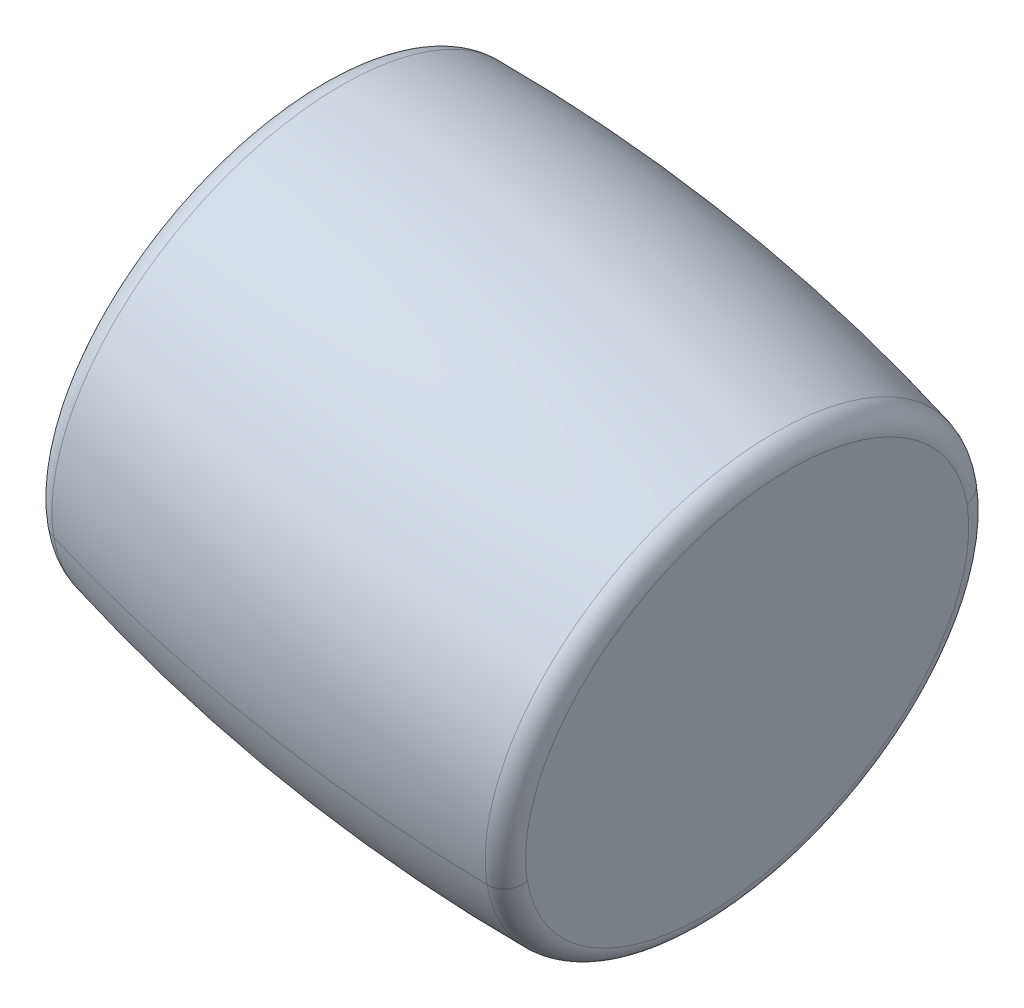
ISO-10303-21;
HEADER;
FILE_DESCRIPTION(('STEP AP214'),'2;1');
FILE_NAME('part.step','',(''),(''),'','','');
FILE_SCHEMA(('AUTOMOTIVE_DESIGN { 1 0 10303 214 1 1 1 1 }'));
ENDSEC;
DATA;
#1=APPLICATION_CONTEXT('core data for automotive mechanical design processes');
#2=APPLICATION_PROTOCOL_DEFINITION('international standard','automotive_design',2000,#1);
#3=PRODUCT_CONTEXT('',#1,'mechanical');
#4=PRODUCT('Part','Part','',(#3));
#5=PRODUCT_RELATED_PRODUCT_CATEGORY('part','',(#4));
#6=PRODUCT_DEFINITION_FORMATION('','',#4);
#7=PRODUCT_DEFINITION_CONTEXT('part definition',#1,'design');
#8=PRODUCT_DEFINITION('design','',#6,#7);
#9=PRODUCT_DEFINITION_SHAPE('','',#8);
#10=(LENGTH_UNIT() NAMED_UNIT(*) SI_UNIT(.MILLI.,.METRE.));
#11=(NAMED_UNIT(*) PLANE_ANGLE_UNIT() SI_UNIT($,.RADIAN.));
#12=(NAMED_UNIT(*) SI_UNIT($,.STERADIAN.) SOLID_ANGLE_UNIT());
#13=UNCERTAINTY_MEASURE_WITH_UNIT(LENGTH_MEASURE(1.E-05),#10,'distance_accuracy_value','');
#14=(GEOMETRIC_REPRESENTATION_CONTEXT(3) GLOBAL_UNCERTAINTY_ASSIGNED_CONTEXT((#13)) GLOBAL_UNIT_ASSIGNED_CONTEXT((#10,
#11,#12)) REPRESENTATION_CONTEXT('',''));
#15=CARTESIAN_POINT('',(0.,0.,0.));
#16=DIRECTION('',(0.,0.,1.));
#17=DIRECTION('',(1.,0.,0.));
#18=AXIS2_PLACEMENT_3D('',#15,#16,#17);
#19=CARTESIAN_POINT('',(48.3031514731134,99.1878484237131,0.));
#20=DIRECTION('',(0.981627183447663,-0.19080899537655,0.));
#21=DIRECTION('',(0.19080899537655,0.981627183447663,0.));
#22=AXIS2_PLACEMENT_3D('',#19,#20,#21);
#23=PLANE('',#22);
#24=CARTESIAN_POINT('',(47.4192131955093,94.6403802077987,14.2576207137951));
#25=CARTESIAN_POINT('',(47.3746990564591,94.4113748149806,14.1818251436028));
#26=CARTESIAN_POINT('',(47.33054058584,94.1841991776182,14.1002941965935));
#27=CARTESIAN_POINT('',(47.2430398123791,93.7340467221097,13.9259793446129));
#28=CARTESIAN_POINT('',(47.1996975095374,93.5110699039636,13.8331954396415));
#29=CARTESIAN_POINT('',(47.113933902546,93.0698543951923,13.6365924674086));
#30=CARTESIAN_POINT('',(47.0715125983965,92.8516157045672,13.532773400147));
#31=CARTESIAN_POINT('',(46.9876930740912,92.4204016341856,13.3143517476095));
#32=CARTESIAN_POINT('',(46.9462948539354,92.2074262544292,13.1997491623336));
#33=CARTESIAN_POINT('',(46.8646212593884,91.7872520356035,12.960036150118));
#34=CARTESIAN_POINT('',(46.8243458849971,91.5800531965343,12.8349257231784));
#35=CARTESIAN_POINT('',(46.7450150008902,91.1719311781116,12.5744985398239));
#36=CARTESIAN_POINT('',(46.7059594911746,90.9710079987581,12.4391817834091));
#37=CARTESIAN_POINT('',(46.6291624267044,90.5759213523236,12.1586679014917));
#38=CARTESIAN_POINT('',(46.59142087195,90.3817578852425,12.0134707759891));
#39=CARTESIAN_POINT('',(46.5173426395395,90.0006584171994,11.7135459564021));
#40=CARTESIAN_POINT('',(46.4810059618835,89.8137224162373,11.5588182623176));
#41=CARTESIAN_POINT('',(46.409825022063,89.4475282264231,11.2402050560143));
#42=CARTESIAN_POINT('',(46.3749807598985,89.268270037571,11.0763195437954));
#43=CARTESIAN_POINT('',(46.3068685938992,88.9178633204429,10.7397855163449));
#44=CARTESIAN_POINT('',(46.2736006900644,88.746714792167,10.5671370011133));
#45=CARTESIAN_POINT('',(46.20872138603,88.4129397080434,10.2134928928804));
#46=CARTESIAN_POINT('',(46.1771099858304,88.2503131521958,10.0324972998793));
#47=CARTESIAN_POINT('',(46.1156198436951,87.9339737945312,9.662595070385));
#48=CARTESIAN_POINT('',(46.0857411017595,87.7802609927142,9.47368843389193));
#49=CARTESIAN_POINT('',(46.0277882566595,87.4821194507182,9.08841921003655));
#50=CARTESIAN_POINT('',(45.9997141534951,87.3376907105391,8.89205662267425));
#51=CARTESIAN_POINT('',(45.9454382189109,87.0584652333034,8.49234855175562));
#52=CARTESIAN_POINT('',(45.9192363874911,86.9236684962466,8.28900306819929));
#53=CARTESIAN_POINT('',(45.8687681189029,86.6640317624023,7.8758190819727));
#54=CARTESIAN_POINT('',(45.8445016817345,86.5391917656147,7.66598057930242));
#55=CARTESIAN_POINT('',(45.797962661622,86.2997692627952,7.24031607418074));
#56=CARTESIAN_POINT('',(45.7756900786778,86.1851867567635,7.02449007172933));
#57=CARTESIAN_POINT('',(45.7331924236166,85.9665552747492,6.58737051078937));
#58=CARTESIAN_POINT('',(45.7129673514996,85.8625062987667,6.36607695230081));
#59=CARTESIAN_POINT('',(45.6746134420632,85.6651925399476,5.91855539485197));
#60=CARTESIAN_POINT('',(45.6564846047438,85.571927757111,5.69232739589169));
#61=CARTESIAN_POINT('',(45.6223668388594,85.3964070676147,5.23548196056415));
#62=CARTESIAN_POINT('',(45.6063779102945,85.3141511609549,5.00486452419688));
#63=CARTESIAN_POINT('',(45.5765784806486,85.1608463854962,4.53979579165928));
#64=CARTESIAN_POINT('',(45.5627679795675,85.0897975166972,4.30534449548894));
#65=CARTESIAN_POINT('',(45.5373586755961,84.9590779799081,3.83317285705315));
#66=CARTESIAN_POINT('',(45.5257598727057,84.8994073119179,3.59545251478771));
#67=CARTESIAN_POINT('',(45.5048019076477,84.7915879286122,3.11731547328809));
#68=CARTESIAN_POINT('',(45.4954427454801,84.7434392132966,2.87689877405391));
#69=CARTESIAN_POINT('',(45.478986608909,84.6587797298124,2.39394820350329));
#70=CARTESIAN_POINT('',(45.4718896345056,84.6222689616439,2.15141433218685));
#71=CARTESIAN_POINT('',(45.4599749706958,84.5609733300925,1.66481370281116));
#72=CARTESIAN_POINT('',(45.4551572812895,84.5361884667095,1.42074694475191));
#73=CARTESIAN_POINT('',(45.4478127937098,84.4984043536359,0.93166852008849));
#74=CARTESIAN_POINT('',(45.4452859955363,84.4854051039454,0.686656853484321));
#75=CARTESIAN_POINT('',(45.4425293777005,84.4712235345876,0.196278866296406));
#76=CARTESIAN_POINT('',(45.4422995580381,84.4700412149205,-0.0490874542873405));
#77=CARTESIAN_POINT('',(45.44413745088,84.4794963539212,-0.539583640476581));
#78=CARTESIAN_POINT('',(45.4462051633843,84.4901338125892,-0.784713506082074));
#79=CARTESIAN_POINT('',(45.4526331392592,84.5232028816905,-1.27414624299772));
#80=CARTESIAN_POINT('',(45.4569934026296,84.5456344921239,-1.51844911430787));
#81=CARTESIAN_POINT('',(45.4679959759804,84.6022378250418,-2.00563931561744));
#82=CARTESIAN_POINT('',(45.4746382859608,84.6364095475263,-2.24852664561687));
#83=CARTESIAN_POINT('',(45.4901889506246,84.7164107818738,-2.73230062745259));
#84=CARTESIAN_POINT('',(45.4990973053082,84.7622402937369,-2.9731872792889));
#85=CARTESIAN_POINT('',(45.5191585983719,84.8654466995333,-3.45237958775493));
#86=CARTESIAN_POINT('',(45.530311536752,84.9228235934666,-3.69068524438467));
#87=CARTESIAN_POINT('',(45.5548351288034,85.0489865374405,-4.16414146323763));
#88=CARTESIAN_POINT('',(45.5682057824747,85.1177725874811,-4.39929202546087));
#89=CARTESIAN_POINT('',(45.5971325940324,85.2665881320499,-4.86587155719969));
#90=CARTESIAN_POINT('',(45.612688751919,85.3466176265781,-5.09730052671527));
#91=CARTESIAN_POINT('',(45.6459490957604,85.5177272620602,-5.55587934038043));
#92=CARTESIAN_POINT('',(45.6636532817153,85.608807403014,-5.78302918453001));
#93=CARTESIAN_POINT('',(45.7011670307589,85.8017989113101,-6.23250252359264));
#94=CARTESIAN_POINT('',(45.7209765938475,85.9037102786524,-6.45482601850568));
#95=CARTESIAN_POINT('',(45.7626533741859,86.1181187263149,-6.89411106232277));
#96=CARTESIAN_POINT('',(45.7845205914357,86.2306158066352,-7.1110726112268));
#97=CARTESIAN_POINT('',(45.8302600000546,86.4659246649339,-7.53911108365095));
#98=CARTESIAN_POINT('',(45.8541321914238,86.5887364429122,-7.75018800717107));
#99=CARTESIAN_POINT('',(45.9038240380816,86.8443788321966,-8.16594872603048));
#100=CARTESIAN_POINT('',(45.9296436933702,86.9772094435027,-8.37063252136977));
#101=CARTESIAN_POINT('',(45.9831682660558,87.2525694988656,-8.77311388267637));
#102=CARTESIAN_POINT('',(46.0108731834528,87.3950989429223,-8.97091144864368));
#103=CARTESIAN_POINT('',(46.0681015367824,87.6895132978715,-9.35914383954487));
#104=CARTESIAN_POINT('',(46.097624972715,87.8413982087639,-9.54957866447875));
#105=CARTESIAN_POINT('',(46.1584192385729,88.1541575933307,-9.92262679913972));
#106=CARTESIAN_POINT('',(46.189690068498,88.315032067005,-10.1052401088668));
#107=CARTESIAN_POINT('',(46.2539037881727,88.6453830164375,-10.462205281656));
#108=CARTESIAN_POINT('',(46.2868466779221,88.8148594921957,-10.6365571447181));
#109=CARTESIAN_POINT('',(46.3543251549384,89.1620061621214,-10.9765793952678));
#110=CARTESIAN_POINT('',(46.3888607422052,89.3396763562889,-11.1422497827554));
#111=CARTESIAN_POINT('',(46.4594414150016,89.7027824399735,-11.4645099676816));
#112=CARTESIAN_POINT('',(46.4954865005312,89.8882183294905,-11.6210997651202));
#113=CARTESIAN_POINT('',(46.5689993340848,90.2664090725741,-11.9248215314108));
#114=CARTESIAN_POINT('',(46.6064670821088,90.4591639261405,-12.0719535002627));
#115=CARTESIAN_POINT('',(46.6827349775647,90.8515282339974,-12.3564051555798));
#116=CARTESIAN_POINT('',(46.7215351249964,91.0511376882877,-12.4937248420449));
#117=CARTESIAN_POINT('',(46.800374346314,91.4567303209331,-12.7582211174357));
#118=CARTESIAN_POINT('',(46.8404134201998,91.6627134992881,-12.8853977063615));
#119=CARTESIAN_POINT('',(46.9216340367896,92.0805573485443,-13.1293014071316));
#120=CARTESIAN_POINT('',(46.9628155794935,92.2924180194455,-13.2460285189759));
#121=CARTESIAN_POINT('',(47.0462219237759,92.7215064628809,-13.4687520597467));
#122=CARTESIAN_POINT('',(47.0884467253544,92.9387342354151,-13.5747484886731));
#123=CARTESIAN_POINT('',(47.1738378641405,93.3780335613857,-13.7757553089265));
#124=CARTESIAN_POINT('',(47.2170042013482,93.6001051148221,-13.8707657002535));
#125=CARTESIAN_POINT('',(47.3041744199054,94.0485570127736,-14.0495715569534));
#126=CARTESIAN_POINT('',(47.3481783012549,94.2749373572886,-14.1333670223262));
#127=CARTESIAN_POINT('',(47.4369175988915,94.7314614673192,-14.2895411565027));
#128=CARTESIAN_POINT('',(47.4816530151785,94.9616052328347,-14.3619198253064));
#129=CARTESIAN_POINT('',(47.5717476111537,95.4251017483759,-14.495085999789));
#130=CARTESIAN_POINT('',(47.6171067908418,95.6584544984017,-14.5558735054678));
#131=CARTESIAN_POINT('',(47.7083396393829,96.1278068157523,-14.6657109112863));
#132=CARTESIAN_POINT('',(47.7542133082359,96.3638063830772,-14.7147608114259));
#133=CARTESIAN_POINT('',(47.8463646214182,96.8378837913861,-14.8010048406183));
#134=CARTESIAN_POINT('',(47.8926422657475,97.0759616323702,-14.838198969671));
#135=CARTESIAN_POINT('',(47.985490042992,97.5536220376672,-14.9006418529319));
#136=CARTESIAN_POINT('',(48.0320601759072,97.7932046019801,-14.9258906071401));
#137=CARTESIAN_POINT('',(48.1253807387637,98.2732972783963,-14.964381913665));
#138=CARTESIAN_POINT('',(48.1721311687051,98.5138073904995,-14.9776244659818));
#139=CARTESIAN_POINT('',(48.2656996998468,98.9951757531532,-14.9920714684443));
#140=CARTESIAN_POINT('',(48.3125178010472,99.2360340037038,-14.9932759185902));
#141=CARTESIAN_POINT('',(48.4061088853773,99.7175183924529,-14.9836438069155));
#142=CARTESIAN_POINT('',(48.4528818685069,99.9581445306515,-14.972807245095));
#143=CARTESIAN_POINT('',(48.5462700380616,100.438585013378,-14.9391192462034));
#144=CARTESIAN_POINT('',(48.5928852244866,100.678399357906,-14.9162678091323));
#145=CARTESIAN_POINT('',(48.685845494671,101.156638489209,-14.858604997066));
#146=CARTESIAN_POINT('',(48.7321905784304,101.395063275984,-14.8237936220706));
#147=CARTESIAN_POINT('',(48.8244990159135,101.869949018745,-14.7422952224666));
#148=CARTESIAN_POINT('',(48.8704623696372,102.106409974732,-14.6956081978578));
#149=CARTESIAN_POINT('',(48.9618965352136,102.576797978445,-14.5904693873083));
#150=CARTESIAN_POINT('',(49.0073673470662,102.810725026171,-14.5320176013676));
#151=CARTESIAN_POINT('',(49.0977071920974,103.275483238728,-14.4034959983673));
#152=CARTESIAN_POINT('',(49.142576225276,103.50631440356,-14.3334261813077));
#153=CARTESIAN_POINT('',(49.1870897507161,103.735316639628,-14.2576207137951));
#154=B_SPLINE_CURVE_WITH_KNOTS('',3,(#24,#25,#26,#27,#28,#29,#30,#31,#32,#33,#34,#35,#36,#37,
#38,#39,#40,#41,#42,#43,#44,#45,#46,#47,#48,#49,#50,#51,#52,#53,#54,#55,#56,#57,#58,#59,#60,#61,
#62,#63,#64,#65,#66,#67,#68,#69,#70,#71,#72,#73,#74,#75,#76,#77,#78,#79,#80,#81,#82,#83,#84,#85,
#86,#87,#88,#89,#90,#91,#92,#93,#94,#95,#96,#97,#98,#99,#100,#101,#102,#103,#104,#105,#106,#107,
#108,#109,#110,#111,#112,#113,#114,#115,#116,#117,#118,#119,#120,#121,#122,#123,#124,#125,#126,
#127,#128,#129,#130,#131,#132,#133,#134,#135,#136,#137,#138,#139,#140,#141,#142,#143,#144,#145,
#146,#147,#148,#149,#150,#151,#152,#153),.UNSPECIFIED.,.F.,.F.,(4,2,2,2,2,2,2,2,2,2,2,2,2,2,2,2,
2,2,2,2,2,2,2,2,2,2,2,2,2,2,2,2,2,2,2,2,2,2,2,2,2,2,2,2,2,2,2,2,2,2,2,2,2,2,2,2,2,2,2,2,2,2,2,2,
4),(0.,0.735812272215512,1.47162454443102,2.20743681664654,2.94324908886205,3.67906136107756,
4.41487363329308,5.15068590550858,5.8864981777241,6.62231044993962,7.35812272215512,
8.09393499437065,8.82974726658616,9.56555953880167,10.3013718110172,11.0371840832327,
11.7729963554482,12.5088086276637,13.2446208998792,13.9804331720948,14.7162454443103,
15.4520577165258,16.1878699887413,16.9236822609568,17.6594945331723,18.3953068053878,
19.1311190776033,19.8669313498189,20.6027436220344,21.3385558942499,22.0743681664654,
22.8101804386809,23.5459927108964,24.2818049831119,25.0176172553274,25.753429527543,
26.4892417997585,27.225054071974,27.9608663441895,28.696678616405,29.4324908886205,
30.168303160836,30.9041154330515,31.6399277052671,32.3757399774826,33.1115522496981,
33.8473645219136,34.5831767941291,35.3189890663446,36.0548013385601,36.7906136107757,
37.5264258829912,38.2622381552067,38.9980504274222,39.7338626996377,40.4696749718532,
41.2054872440687,41.9412995162843,42.6771117884998,43.4129240607153,44.1487363329308,
44.8845486051463,45.6203608773618,46.3561731495773,47.0919854217929),.UNSPECIFIED.);
#155=CARTESIAN_POINT('',(47.4192131955093,94.6403802077988,14.2576207137951));
#156=VERTEX_POINT('',#155);
#157=CARTESIAN_POINT('',(49.1870897507161,103.735316639628,-14.2576207137951));
#158=VERTEX_POINT('',#157);
#159=EDGE_CURVE('E10',#156,#158,#154,.T.);
#160=ORIENTED_EDGE('',*,*,#159,.F.);
#161=CARTESIAN_POINT('',(49.1870897507161,103.735316639628,-14.2576207137951));
#162=CARTESIAN_POINT('',(49.2316038897663,103.964322032446,-14.1818251436028));
#163=CARTESIAN_POINT('',(49.2757623603854,104.191497669808,-14.1002941965935));
#164=CARTESIAN_POINT('',(49.3632631338462,104.641650125317,-13.9259793446129));
#165=CARTESIAN_POINT('',(49.406605436688,104.864626943463,-13.8331954396415));
#166=CARTESIAN_POINT('',(49.4923690436793,105.305842452234,-13.6365924674086));
#167=CARTESIAN_POINT('',(49.5347903478289,105.524081142859,-13.532773400147));
#168=CARTESIAN_POINT('',(49.6186098721342,105.955295213241,-13.3143517476095));
#169=CARTESIAN_POINT('',(49.6600080922899,106.168270592997,-13.1997491623336));
#170=CARTESIAN_POINT('',(49.741681686837,106.588444811823,-12.960036150118));
#171=CARTESIAN_POINT('',(49.7819570612282,106.795643650892,-12.8349257231784));
#172=CARTESIAN_POINT('',(49.8612879453351,107.203765669315,-12.5744985398239));
#173=CARTESIAN_POINT('',(49.9003434550508,107.404688848668,-12.4391817834091));
#174=CARTESIAN_POINT('',(49.977140519521,107.799775495103,-12.1586679014917));
#175=CARTESIAN_POINT('',(50.0148820742754,107.993938962184,-12.0134707759891));
#176=CARTESIAN_POINT('',(50.0889603066859,108.375038430227,-11.7135459564021));
#177=CARTESIAN_POINT('',(50.1252969843418,108.561974431189,-11.5588182623177));
#178=CARTESIAN_POINT('',(50.1964779241624,108.928168621003,-11.2402050560143));
#179=CARTESIAN_POINT('',(50.2313221863269,109.107426809855,-11.0763195437954));
#180=CARTESIAN_POINT('',(50.2994343523262,109.457833526984,-10.7397855163449));
#181=CARTESIAN_POINT('',(50.3327022561609,109.62898205526,-10.5671370011133));
#182=CARTESIAN_POINT('',(50.3975815601954,109.962757139383,-10.2134928928805));
#183=CARTESIAN_POINT('',(50.429192960395,110.125383695231,-10.0324972998793));
#184=CARTESIAN_POINT('',(50.4906831025303,110.441723052895,-9.662595070385));
#185=CARTESIAN_POINT('',(50.5205618444659,110.595435854712,-9.47368843389193));
#186=CARTESIAN_POINT('',(50.5785146895659,110.893577396708,-9.08841921003656));
#187=CARTESIAN_POINT('',(50.6065887927303,111.038006136887,-8.89205662267425));
#188=CARTESIAN_POINT('',(50.6608647273145,111.317231614123,-8.49234855175563));
#189=CARTESIAN_POINT('',(50.6870665587343,111.45202835118,-8.2890030681993));
#190=CARTESIAN_POINT('',(50.7375348273225,111.711665085024,-7.87581908197271));
#191=CARTESIAN_POINT('',(50.7618012644908,111.836505081812,-7.66598057930243));
#192=CARTESIAN_POINT('',(50.8083402846034,112.075927584631,-7.24031607418075));
#193=CARTESIAN_POINT('',(50.8306128675476,112.190510090663,-7.02449007172934));
#194=CARTESIAN_POINT('',(50.8731105226088,112.409141572677,-6.58737051078938));
#195=CARTESIAN_POINT('',(50.8933355947257,112.51319054866,-6.36607695230081));
#196=CARTESIAN_POINT('',(50.9316895041621,112.710504307479,-5.91855539485197));
#197=CARTESIAN_POINT('',(50.9498183414816,112.803769090316,-5.6923273958917));
#198=CARTESIAN_POINT('',(50.9839361073659,112.979289779812,-5.23548196056416));
#199=CARTESIAN_POINT('',(50.9999250359309,113.061545686472,-5.0048645241969));
#200=CARTESIAN_POINT('',(51.0297244655768,113.21485046193,-4.53979579165929));
#201=CARTESIAN_POINT('',(51.0435349666578,113.285899330729,-4.30534449548894));
#202=CARTESIAN_POINT('',(51.0689442706293,113.416618867518,-3.83317285705316));
#203=CARTESIAN_POINT('',(51.0805430735196,113.476289535509,-3.59545251478772));
#204=CARTESIAN_POINT('',(51.1015010385776,113.584108918814,-3.1173154732881));
#205=CARTESIAN_POINT('',(51.1108602007453,113.63225763413,-2.87689877405393));
#206=CARTESIAN_POINT('',(51.1273163373164,113.716917117614,-2.39394820350331));
#207=CARTESIAN_POINT('',(51.1344133117198,113.753427885783,-2.15141433218686));
#208=CARTESIAN_POINT('',(51.1463279755296,113.814723517334,-1.66481370281117));
#209=CARTESIAN_POINT('',(51.1511456649359,113.839508380717,-1.42074694475192));
#210=CARTESIAN_POINT('',(51.1584901525156,113.877292493791,-0.931668520088506));
#211=CARTESIAN_POINT('',(51.161016950689,113.890291743481,-0.686656853484336));
#212=CARTESIAN_POINT('',(51.1637735685249,113.904473312839,-0.196278866296419));
#213=CARTESIAN_POINT('',(51.1640033881873,113.905655632506,0.0490874542873292));
#214=CARTESIAN_POINT('',(51.1621654953453,113.896200493505,0.539583640476569));
#215=CARTESIAN_POINT('',(51.160097782841,113.885563034837,0.784713506082062));
#216=CARTESIAN_POINT('',(51.1536698069662,113.852493965736,1.2741462429977));
#217=CARTESIAN_POINT('',(51.1493095435957,113.830062355303,1.51844911430786));
#218=CARTESIAN_POINT('',(51.1383069702449,113.773459022385,2.00563931561743));
#219=CARTESIAN_POINT('',(51.1316646602646,113.7392872999,2.24852664561684));
#220=CARTESIAN_POINT('',(51.1161139956007,113.659286065553,2.73230062745257));
#221=CARTESIAN_POINT('',(51.1072056409172,113.61345655369,2.97318727928888));
#222=CARTESIAN_POINT('',(51.0871443478535,113.510250147893,3.45237958775492));
#223=CARTESIAN_POINT('',(51.0759914094733,113.45287325396,3.69068524438465));
#224=CARTESIAN_POINT('',(51.051467817422,113.326710309986,4.16414146323762));
#225=CARTESIAN_POINT('',(51.0380971637507,113.257924259945,4.39929202546086));
#226=CARTESIAN_POINT('',(51.0091703521929,113.109108715377,4.86587155719967));
#227=CARTESIAN_POINT('',(50.9936141943064,113.029079220848,5.09730052671525));
#228=CARTESIAN_POINT('',(50.960353850465,112.857969585366,5.55587934038041));
#229=CARTESIAN_POINT('',(50.94264966451,112.766889444412,5.78302918452999));
#230=CARTESIAN_POINT('',(50.9051359154665,112.573897936116,6.23250252359263));
#231=CARTESIAN_POINT('',(50.8853263523779,112.471986568774,6.45482601850568));
#232=CARTESIAN_POINT('',(50.8436495720395,112.257578121112,6.89411106232276));
#233=CARTESIAN_POINT('',(50.8217823547897,112.145081040791,7.11107261122679));
#234=CARTESIAN_POINT('',(50.7760429461708,111.909772182493,7.53911108365094));
#235=CARTESIAN_POINT('',(50.7521707548016,111.786960404514,7.75018800717106));
#236=CARTESIAN_POINT('',(50.7024789081438,111.53131801523,8.16594872603047));
#237=CARTESIAN_POINT('',(50.6766592528552,111.398487403924,8.37063252136975));
#238=CARTESIAN_POINT('',(50.6231346801695,111.123127348561,8.77311388267635));
#239=CARTESIAN_POINT('',(50.5954297627726,110.980597904504,8.97091144864366));
#240=CARTESIAN_POINT('',(50.538201409443,110.686183549555,9.35914383954486));
#241=CARTESIAN_POINT('',(50.5086779735103,110.534298638663,9.54957866447874));
#242=CARTESIAN_POINT('',(50.4478837076525,110.221539254096,9.92262679913971));
#243=CARTESIAN_POINT('',(50.4166128777273,110.060664780421,10.1052401088668));
#244=CARTESIAN_POINT('',(50.3523991580527,109.730313830989,10.462205281656));
#245=CARTESIAN_POINT('',(50.3194562683033,109.560837355231,10.6365571447181));
#246=CARTESIAN_POINT('',(50.251977791287,109.213690685305,10.9765793952678));
#247=CARTESIAN_POINT('',(50.2174422040201,109.036020491138,11.1422497827554));
#248=CARTESIAN_POINT('',(50.1468615312237,108.672914407453,11.4645099676816));
#249=CARTESIAN_POINT('',(50.1108164456942,108.487478517936,11.6210997651202));
#250=CARTESIAN_POINT('',(50.0373036121406,108.109287774852,11.9248215314108));
#251=CARTESIAN_POINT('',(49.9998358641165,107.916532921286,12.0719535002627));
#252=CARTESIAN_POINT('',(49.9235679686607,107.524168613429,12.3564051555798));
#253=CARTESIAN_POINT('',(49.8847678212289,107.324559159139,12.4937248420448));
#254=CARTESIAN_POINT('',(49.8059285999114,106.918966526493,12.7582211174357));
#255=CARTESIAN_POINT('',(49.7658895260255,106.712983348138,12.8853977063615));
#256=CARTESIAN_POINT('',(49.6846689094358,106.295139498882,13.1293014071316));
#257=CARTESIAN_POINT('',(49.6434873667319,106.083278827981,13.2460285189759));
#258=CARTESIAN_POINT('',(49.5600810224495,105.654190384546,13.4687520597466));
#259=CARTESIAN_POINT('',(49.517856220871,105.436962612011,13.574748488673));
#260=CARTESIAN_POINT('',(49.4324650820849,104.997663286041,13.7757553089265));
#261=CARTESIAN_POINT('',(49.3892987448772,104.775591732604,13.8707657002535));
#262=CARTESIAN_POINT('',(49.30212852632,104.327139834653,14.0495715569534));
#263=CARTESIAN_POINT('',(49.2581246449705,104.100759490138,14.1333670223262));
#264=CARTESIAN_POINT('',(49.1693853473339,103.644235380107,14.2895411565027));
#265=CARTESIAN_POINT('',(49.1246499310469,103.414091614592,14.3619198253064));
#266=CARTESIAN_POINT('',(49.0345553350717,102.950595099051,14.495085999789));
#267=CARTESIAN_POINT('',(48.9891961553836,102.717242349025,14.5558735054678));
#268=CARTESIAN_POINT('',(48.8979633068424,102.247890031674,14.6657109112863));
#269=CARTESIAN_POINT('',(48.8520896379895,102.011890464349,14.7147608114259));
#270=CARTESIAN_POINT('',(48.7599383248072,101.53781305604,14.8010048406183));
#271=CARTESIAN_POINT('',(48.7136606804778,101.299735215056,14.838198969671));
#272=CARTESIAN_POINT('',(48.6208129032334,100.822074809759,14.9006418529319));
#273=CARTESIAN_POINT('',(48.5742427703182,100.582492245446,14.9258906071401));
#274=CARTESIAN_POINT('',(48.4809222074617,100.10239956903,14.964381913665));
#275=CARTESIAN_POINT('',(48.4341717775203,99.861889456927,14.9776244659818));
#276=CARTESIAN_POINT('',(48.3406032463785,99.3805210942733,14.9920714684443));
#277=CARTESIAN_POINT('',(48.2937851451782,99.1396628437228,14.9932759185902));
#278=CARTESIAN_POINT('',(48.2001940608481,98.6581784549737,14.9836438069155));
#279=CARTESIAN_POINT('',(48.1534210777185,98.4175523167751,14.972807245095));
#280=CARTESIAN_POINT('',(48.0600329081638,97.9371118340486,14.9391192462034));
#281=CARTESIAN_POINT('',(48.0134177217388,97.6972974895207,14.9162678091323));
#282=CARTESIAN_POINT('',(47.9204574515544,97.2190583582179,14.858604997066));
#283=CARTESIAN_POINT('',(47.874112367795,96.980633571443,14.8237936220707));
#284=CARTESIAN_POINT('',(47.7818039303119,96.5057478286812,14.7422952224666));
#285=CARTESIAN_POINT('',(47.7358405765881,96.2692868726943,14.6956081978578));
#286=CARTESIAN_POINT('',(47.6444064110118,95.7988988689815,14.5904693873083));
#287=CARTESIAN_POINT('',(47.5989355991591,95.5649718212556,14.5320176013676));
#288=CARTESIAN_POINT('',(47.5085957541279,95.1002136086982,14.4034959983673));
#289=CARTESIAN_POINT('',(47.4637267209494,94.8693824438666,14.3334261813077));
#290=CARTESIAN_POINT('',(47.4192131955093,94.6403802077988,14.2576207137952));
#291=B_SPLINE_CURVE_WITH_KNOTS('',3,(#161,#162,#163,#164,#165,#166,#167,#168,#169,#170,#171,
#172,#173,#174,#175,#176,#177,#178,#179,#180,#181,#182,#183,#184,#185,#186,#187,#188,#189,#190,
#191,#192,#193,#194,#195,#196,#197,#198,#199,#200,#201,#202,#203,#204,#205,#206,#207,#208,#209,
#210,#211,#212,#213,#214,#215,#216,#217,#218,#219,#220,#221,#222,#223,#224,#225,#226,#227,#228,
#229,#230,#231,#232,#233,#234,#235,#236,#237,#238,#239,#240,#241,#242,#243,#244,#245,#246,#247,
#248,#249,#250,#251,#252,#253,#254,#255,#256,#257,#258,#259,#260,#261,#262,#263,#264,#265,#266,
#267,#268,#269,#270,#271,#272,#273,#274,#275,#276,#277,#278,#279,#280,#281,#282,#283,#284,#285,
#286,#287,#288,#289,#290),.UNSPECIFIED.,.F.,.F.,(4,2,2,2,2,2,2,2,2,2,2,2,2,2,2,2,2,2,2,2,2,2,2,
2,2,2,2,2,2,2,2,2,2,2,2,2,2,2,2,2,2,2,2,2,2,2,2,2,2,2,2,2,2,2,2,2,2,2,2,2,2,2,2,2,4),(0.,
0.735812272215512,1.47162454443102,2.20743681664654,2.94324908886205,3.67906136107756,
4.41487363329308,5.15068590550858,5.8864981777241,6.62231044993962,7.35812272215513,
8.09393499437064,8.82974726658615,9.56555953880166,10.3013718110172,11.0371840832327,
11.7729963554482,12.5088086276637,13.2446208998792,13.9804331720947,14.7162454443103,
15.4520577165258,16.1878699887413,16.9236822609568,17.6594945331723,18.3953068053878,
19.1311190776033,19.8669313498188,20.6027436220344,21.3385558942499,22.0743681664654,
22.8101804386809,23.5459927108964,24.2818049831119,25.0176172553274,25.753429527543,
26.4892417997585,27.225054071974,27.9608663441895,28.696678616405,29.4324908886205,
30.168303160836,30.9041154330515,31.6399277052671,32.3757399774826,33.1115522496981,
33.8473645219136,34.5831767941291,35.3189890663446,36.0548013385601,36.7906136107757,
37.5264258829912,38.2622381552067,38.9980504274222,39.7338626996377,40.4696749718532,
41.2054872440687,41.9412995162842,42.6771117884998,43.4129240607153,44.1487363329308,
44.8845486051463,45.6203608773618,46.3561731495773,47.0919854217929),.UNSPECIFIED.);
#292=EDGE_CURVE('E25',#158,#156,#291,.T.);
#293=ORIENTED_EDGE('',*,*,#292,.F.);
#294=EDGE_LOOP('',(#160,#293));
#295=FACE_BOUND('',#294,.T.);
#296=ADVANCED_FACE('F16',(#295),#23,.F.);
#297=CARTESIAN_POINT('',(49.7755922482884,98.9016349306476,0.));
#298=DIRECTION('',(0.981627183447663,-0.19080899537655,0.));
#299=DIRECTION('',(-0.1814701384206,-0.933582929390358,-0.309016994374947));
#300=AXIS2_PLACEMENT_3D('',#297,#298,#299);
#301=TOROIDAL_SURFACE('',#300,14.9913495880726,1.5000000000043);
#302=CARTESIAN_POINT('',(50.6595305258918,103.449103146562,-14.2576207137951));
#303=DIRECTION('',(0.181470138420601,0.933582929390356,0.309016994374954));
#304=DIRECTION('',(-0.0729891787354728,0.326154394757181,-0.942494504264135));
#305=AXIS2_PLACEMENT_3D('',#302,#303,#304);
#306=CIRCLE('',#305,1.5000000000043);
#307=CARTESIAN_POINT('',(50.5500467577883,103.938334738699,-15.6713624701954));
#308=VERTEX_POINT('',#307);
#309=EDGE_CURVE('E103',#308,#158,#306,.T.);
#310=ORIENTED_EDGE('',*,*,#309,.T.);
#311=ORIENTED_EDGE('',*,*,#292,.T.);
#312=CARTESIAN_POINT('',(48.891653970685,94.3541667147331,14.2576207137951));
#313=DIRECTION('',(-0.1814701384206,-0.933582929390357,-0.309016994374949));
#314=DIRECTION('',(-0.189853974829239,-0.275062861312533,0.942494504264137));
#315=AXIS2_PLACEMENT_3D('',#312,#313,#314);
#316=CIRCLE('',#315,1.5000000000043);
#317=CARTESIAN_POINT('',(48.6068730084403,93.9415724227631,15.6713624701954));
#318=VERTEX_POINT('',#317);
#319=EDGE_CURVE('E99',#318,#156,#316,.T.);
#320=ORIENTED_EDGE('',*,*,#319,.F.);
#321=CARTESIAN_POINT('',(49.5784598831143,98.9399535807312,0.));
#322=DIRECTION('',(0.981627183447663,-0.19080899537655,0.));
#323=DIRECTION('',(0.0589632222509648,0.303339481825742,-0.951056516295154));
#324=AXIS2_PLACEMENT_3D('',#321,#322,#323);
#325=CIRCLE('',#324,16.4778456397557);
#326=EDGE_CURVE('E94',#308,#318,#325,.T.);
#327=ORIENTED_EDGE('',*,*,#326,.F.);
#328=EDGE_LOOP('',(#310,#311,#320,#327));
#329=FACE_BOUND('',#328,.T.);
#330=ADVANCED_FACE('F110',(#329),#301,.T.);
#331=CARTESIAN_POINT('',(64.5000000000079,96.0394999999985,0.));
#332=DIRECTION('',(0.981627183447663,-0.19080899537655,0.));
#333=DIRECTION('',(-0.1814701384206,-0.933582929390358,-0.309016994374947));
#334=AXIS2_PLACEMENT_3D('',#331,#332,#333);
#335=DEGENERATE_TOROIDAL_SURFACE('',#334,96.0395000005948,113.539500000591,.F.);
#336=CARTESIAN_POINT('',(58.8372016166013,66.9069278350147,91.3389922972941));
#337=DIRECTION('',(0.1814701384206,0.933582929390358,0.309016994374948));
#338=DIRECTION('',(0.189853974826782,0.275062861313117,-0.942494504264461));
#339=AXIS2_PLACEMENT_3D('',#336,#337,#338);
#340=CIRCLE('',#339,113.539500000591);
#341=CARTESIAN_POINT('',(80.3931269915589,98.1374275772378,-15.6713624701976));
#342=VERTEX_POINT('',#341);
#343=EDGE_CURVE('E89',#342,#308,#340,.T.);
#344=ORIENTED_EDGE('',*,*,#343,.T.);
#345=ORIENTED_EDGE('',*,*,#326,.T.);
#346=CARTESIAN_POINT('',(70.1627983834145,125.172072164982,-91.3389922972941));
#347=DIRECTION('',(-0.1814701384206,-0.933582929390358,-0.309016994374947));
#348=DIRECTION('',(0.0729891787329788,-0.326154394756797,0.942494504264461));
#349=AXIS2_PLACEMENT_3D('',#346,#347,#348);
#350=CIRCLE('',#349,113.539500000591);
#351=CARTESIAN_POINT('',(78.4499532422107,88.1406652613002,15.6713624701976));
#352=VERTEX_POINT('',#351);
#353=EDGE_CURVE('E78',#352,#318,#350,.T.);
#354=ORIENTED_EDGE('',*,*,#353,.F.);
#355=CARTESIAN_POINT('',(79.4215401168849,93.139046419269,0.));
#356=DIRECTION('',(0.981627183447663,-0.19080899537655,0.));
#357=DIRECTION('',(0.0589632222509648,0.303339481825742,-0.951056516295154));
#358=AXIS2_PLACEMENT_3D('',#355,#356,#357);
#359=CIRCLE('',#358,16.4778456397581);
#360=EDGE_CURVE('E76',#342,#352,#359,.T.);
#361=ORIENTED_EDGE('',*,*,#360,.F.);
#362=EDGE_LOOP('',(#344,#345,#354,#361));
#363=FACE_BOUND('',#362,.T.);
#364=ADVANCED_FACE('F119',(#363),#335,.F.);
#365=CARTESIAN_POINT('',(79.2244077517033,93.177365069354,0.));
#366=DIRECTION('',(0.981627183447663,-0.19080899537655,0.));
#367=DIRECTION('',(-0.1814701384206,-0.933582929390358,-0.309016994374947));
#368=AXIS2_PLACEMENT_3D('',#365,#366,#367);
#369=TOROIDAL_SURFACE('',#368,14.9913495880683,1.50000000001185);
#370=CARTESIAN_POINT('',(80.1083460293065,97.7248332852672,-14.257620713791));
#371=DIRECTION('',(0.181470138420605,0.933582929390357,0.309016994374947));
#372=DIRECTION('',(0.981627183447662,-0.190808995376555,0.));
#373=AXIS2_PLACEMENT_3D('',#370,#371,#372);
#374=CIRCLE('',#373,1.50000000001186);
#375=CARTESIAN_POINT('',(81.5807868044896,97.4386197922001,-14.257620713791));
#376=VERTEX_POINT('',#375);
#377=EDGE_CURVE('E60',#376,#342,#374,.T.);
#378=ORIENTED_EDGE('',*,*,#377,.T.);
#379=ORIENTED_EDGE('',*,*,#360,.T.);
#380=CARTESIAN_POINT('',(78.3404694741001,88.6298968534408,14.257620713791));
#381=DIRECTION('',(-0.181470138420596,-0.933582929390359,-0.309016994374947));
#382=DIRECTION('',(0.981627183447664,-0.190808995376546,0.));
#383=AXIS2_PLACEMENT_3D('',#380,#381,#382);
#384=CIRCLE('',#383,1.50000000001185);
#385=CARTESIAN_POINT('',(79.8129102492832,88.3436833603737,14.257620713791));
#386=VERTEX_POINT('',#385);
#387=EDGE_CURVE('E62',#386,#352,#384,.T.);
#388=ORIENTED_EDGE('',*,*,#387,.F.);
#389=CARTESIAN_POINT('',(81.5807868044899,97.4386197922027,-14.2576207137991));
#390=CARTESIAN_POINT('',(82.0081151640792,99.6370336206658,-13.5299069119308));
#391=CARTESIAN_POINT('',(82.4082054532413,101.695319724526,-12.3626374781856));
#392=CARTESIAN_POINT('',(82.7589864683556,103.499931604558,-10.7924209596607));
#393=CARTESIAN_POINT('',(83.3241509205507,106.407450656782,-7.01580101704071));
#394=CARTESIAN_POINT('',(83.5749466859527,107.697683018869,-2.39969817130271));
#395=CARTESIAN_POINT('',(83.6111421646543,107.883892614183,0.0105508697637023));
#396=CARTESIAN_POINT('',(83.5012180730577,107.318382187308,4.77542947736118));
#397=CARTESIAN_POINT('',(83.0557449362148,105.026621572156,8.96891734084028));
#398=CARTESIAN_POINT('',(82.7561413881923,103.485294935978,10.807349956045));
#399=CARTESIAN_POINT('',(82.0355256597742,99.7780483963734,13.7692816927832));
#400=CARTESIAN_POINT('',(81.1547322857176,95.2467593066305,15.0836478158485));
#401=CARTESIAN_POINT('',(80.6948372994383,92.8808047080426,15.2734021627849));
#402=CARTESIAN_POINT('',(80.2402426873178,90.5421181706197,14.9852687317356));
#403=CARTESIAN_POINT('',(79.8129102492825,88.3436833603712,14.2576207137991));
#404=B_SPLINE_CURVE_WITH_KNOTS('',5,(#389,#390,#391,#392,#393,#394,#395,#396,#397,#398,#399,
#400,#401,#402,#403),.UNSPECIFIED.,.F.,.F.,(6,3,3,3,6),(0.,0.785398163397448,1.5707963267949,
2.35619449019234,3.14159265358979),.UNSPECIFIED.);
#405=EDGE_CURVE('E54',#376,#386,#404,.T.);
#406=ORIENTED_EDGE('',*,*,#405,.F.);
#407=EDGE_LOOP('',(#378,#379,#388,#406));
#408=FACE_BOUND('',#407,.T.);
#409=ADVANCED_FACE('F57',(#408),#369,.T.);
#410=CARTESIAN_POINT('',(83.5573328811258,107.60706784851,0.));
#411=DIRECTION('',(-0.981627183447663,0.19080899537655,0.));
#412=DIRECTION('',(-0.19080899537655,-0.981627183447663,0.));
#413=AXIS2_PLACEMENT_3D('',#410,#411,#412);
#414=PLANE('',#413);
#415=ORIENTED_EDGE('',*,*,#405,.T.);
#416=CARTESIAN_POINT('',(80.6968485268864,92.8911515762869,0.));
#417=DIRECTION('',(0.981627183447663,-0.19080899537655,0.));
#418=DIRECTION('',(0.19080899537655,0.981627183447663,0.));
#419=AXIS2_PLACEMENT_3D('',#416,#417,#418);
#420=CIRCLE('',#419,14.9913495880768);
#421=EDGE_CURVE('E66',#386,#376,#420,.T.);
#422=ORIENTED_EDGE('',*,*,#421,.T.);
#423=EDGE_LOOP('',(#415,#422));
#424=FACE_BOUND('',#423,.T.);
#425=ADVANCED_FACE('F69',(#424),#414,.F.);
#426=CARTESIAN_POINT('',(79.2244077517033,93.177365069354,0.));
#427=DIRECTION('',(0.981627183447663,-0.190808995376551,0.));
#428=DIRECTION('',(0.1814701384206,0.933582929390355,0.309016994374955));
#429=AXIS2_PLACEMENT_3D('',#426,#427,#428);
#430=TOROIDAL_SURFACE('',#429,14.9913495880683,1.50000000001185);
#431=ORIENTED_EDGE('',*,*,#377,.F.);
#432=ORIENTED_EDGE('',*,*,#421,.F.);
#433=ORIENTED_EDGE('',*,*,#387,.T.);
#434=CARTESIAN_POINT('',(79.4215401168849,93.139046419269,0.));
#435=DIRECTION('',(0.981627183447663,-0.19080899537655,0.));
#436=DIRECTION('',(0.19080899537655,0.981627183447663,0.));
#437=AXIS2_PLACEMENT_3D('',#434,#435,#436);
#438=CIRCLE('',#437,16.4778456397581);
#439=EDGE_CURVE('E71',#352,#342,#438,.T.);
#440=ORIENTED_EDGE('',*,*,#439,.T.);
#441=EDGE_LOOP('',(#431,#432,#433,#440));
#442=FACE_BOUND('',#441,.T.);
#443=ADVANCED_FACE('F74',(#442),#430,.T.);
#444=CARTESIAN_POINT('',(64.5000000000079,96.0394999999985,0.));
#445=DIRECTION('',(0.981627183447663,-0.19080899537655,0.));
#446=DIRECTION('',(0.1814701384206,0.933582929390358,0.309016994374948));
#447=AXIS2_PLACEMENT_3D('',#444,#445,#446);
#448=DEGENERATE_TOROIDAL_SURFACE('',#447,96.0395000005948,113.539500000591,.F.);
#449=ORIENTED_EDGE('',*,*,#343,.F.);
#450=ORIENTED_EDGE('',*,*,#439,.F.);
#451=ORIENTED_EDGE('',*,*,#353,.T.);
#452=CARTESIAN_POINT('',(49.5784598831143,98.9399535807312,0.));
#453=DIRECTION('',(0.981627183447663,-0.19080899537655,0.));
#454=DIRECTION('',(0.19080899537655,0.981627183447663,0.));
#455=AXIS2_PLACEMENT_3D('',#452,#453,#454);
#456=CIRCLE('',#455,16.4778456397557);
#457=EDGE_CURVE('E150',#318,#308,#456,.T.);
#458=ORIENTED_EDGE('',*,*,#457,.T.);
#459=EDGE_LOOP('',(#449,#450,#451,#458));
#460=FACE_BOUND('',#459,.T.);
#461=ADVANCED_FACE('F170',(#460),#448,.F.);
#462=CARTESIAN_POINT('',(49.7755922482884,98.9016349306476,0.));
#463=DIRECTION('',(0.981627183447663,-0.19080899537655,0.));
#464=DIRECTION('',(0.1814701384206,0.933582929390358,0.309016994374947));
#465=AXIS2_PLACEMENT_3D('',#462,#463,#464);
#466=TOROIDAL_SURFACE('',#465,14.9913495880726,1.5000000000043);
#467=ORIENTED_EDGE('',*,*,#309,.F.);
#468=ORIENTED_EDGE('',*,*,#457,.F.);
#469=ORIENTED_EDGE('',*,*,#319,.T.);
#470=ORIENTED_EDGE('',*,*,#159,.T.);
#471=EDGE_LOOP('',(#467,#468,#469,#470));
#472=FACE_BOUND('',#471,.T.);
#473=ADVANCED_FACE('F161',(#472),#466,.T.);
#474=CLOSED_SHELL('',(#296,#330,#364,#409,#425,#443,#461,#473));
#475=MANIFOLD_SOLID_BREP('B1',#474);
#476=ADVANCED_BREP_SHAPE_REPRESENTATION('',(#18,#475),#14);
#477=SHAPE_DEFINITION_REPRESENTATION(#9,#476);
ENDSEC;
END-ISO-10303-21;
